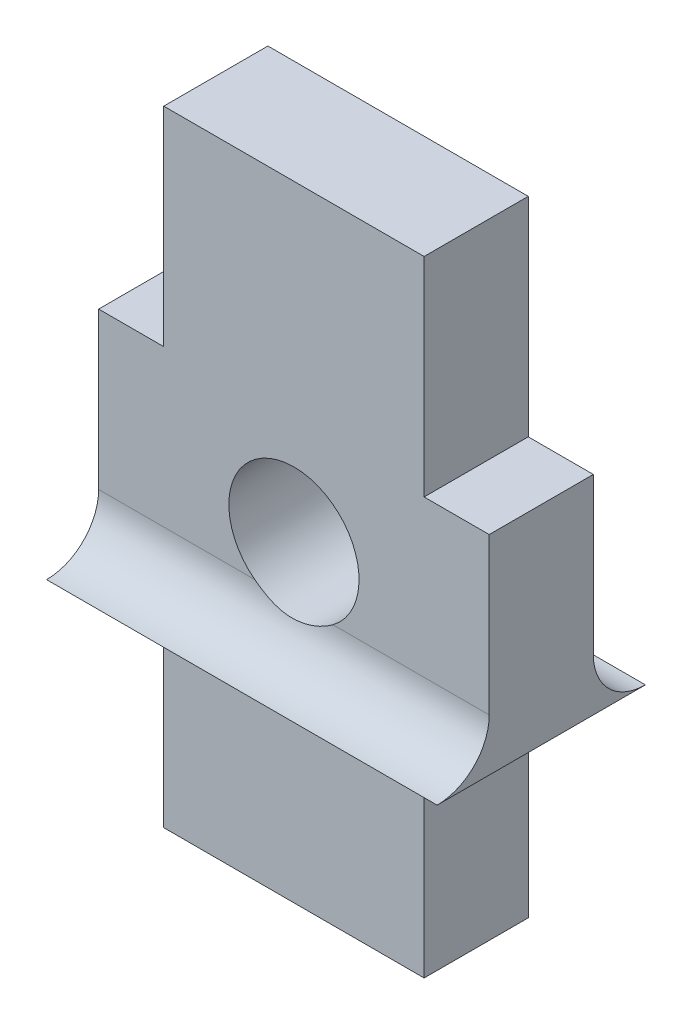
ISO-10303-21;
HEADER;
FILE_DESCRIPTION(('STEP AP214'),'2;1');
FILE_NAME('part.step','',(''),(''),'','','');
FILE_SCHEMA(('AUTOMOTIVE_DESIGN { 1 0 10303 214 1 1 1 1 }'));
ENDSEC;
DATA;
#1=APPLICATION_CONTEXT('core data for automotive mechanical design processes');
#2=APPLICATION_PROTOCOL_DEFINITION('international standard','automotive_design',2000,#1);
#3=PRODUCT_CONTEXT('',#1,'mechanical');
#4=PRODUCT('Part','Part','',(#3));
#5=PRODUCT_RELATED_PRODUCT_CATEGORY('part','',(#4));
#6=PRODUCT_DEFINITION_FORMATION('','',#4);
#7=PRODUCT_DEFINITION_CONTEXT('part definition',#1,'design');
#8=PRODUCT_DEFINITION('design','',#6,#7);
#9=PRODUCT_DEFINITION_SHAPE('','',#8);
#10=(LENGTH_UNIT() NAMED_UNIT(*) SI_UNIT(.MILLI.,.METRE.));
#11=(NAMED_UNIT(*) PLANE_ANGLE_UNIT() SI_UNIT($,.RADIAN.));
#12=(NAMED_UNIT(*) SI_UNIT($,.STERADIAN.) SOLID_ANGLE_UNIT());
#13=UNCERTAINTY_MEASURE_WITH_UNIT(LENGTH_MEASURE(1.E-05),#10,'distance_accuracy_value','');
#14=(GEOMETRIC_REPRESENTATION_CONTEXT(3) GLOBAL_UNCERTAINTY_ASSIGNED_CONTEXT((#13)) GLOBAL_UNIT_ASSIGNED_CONTEXT((#10,
#11,#12)) REPRESENTATION_CONTEXT('',''));
#15=CARTESIAN_POINT('',(0.,0.,0.));
#16=DIRECTION('',(0.,0.,1.));
#17=DIRECTION('',(1.,0.,0.));
#18=AXIS2_PLACEMENT_3D('',#15,#16,#17);
#19=CARTESIAN_POINT('',(0.,0.,0.));
#20=DIRECTION('',(0.,0.,-1.));
#21=DIRECTION('',(-1.,0.,0.));
#22=AXIS2_PLACEMENT_3D('',#19,#20,#21);
#23=PLANE('',#22);
#24=DIRECTION('',(-1.,0.,0.));
#25=VECTOR('',#24,1.);
#26=CARTESIAN_POINT('',(1959.84102228349,1459.88411595094,0.));
#27=LINE('',#26,#25);
#28=CARTESIAN_POINT('',(1953.92680872112,1459.88411595094,0.));
#29=VERTEX_POINT('',#28);
#30=CARTESIAN_POINT('',(1950.92680872112,1459.88411595094,0.));
#31=VERTEX_POINT('',#30);
#32=EDGE_CURVE('E50',#29,#31,#27,.T.);
#33=ORIENTED_EDGE('',*,*,#32,.T.);
#34=DIRECTION('',(0.,-1.,0.));
#35=VECTOR('',#34,1.);
#36=CARTESIAN_POINT('',(1950.92680872112,1462.88411595094,0.));
#37=LINE('',#36,#35);
#38=CARTESIAN_POINT('',(1950.92680872112,1462.88411595094,0.));
#39=VERTEX_POINT('',#38);
#40=EDGE_CURVE('E225',#39,#31,#37,.T.);
#41=ORIENTED_EDGE('',*,*,#40,.F.);
#42=DIRECTION('',(-1.,0.,0.));
#43=VECTOR('',#42,1.);
#44=CARTESIAN_POINT('',(1952.17680872112,1462.88411595094,0.));
#45=LINE('',#44,#43);
#46=CARTESIAN_POINT('',(1952.17680872112,1462.88411595094,0.));
#47=VERTEX_POINT('',#46);
#48=EDGE_CURVE('E223',#47,#39,#45,.T.);
#49=ORIENTED_EDGE('',*,*,#48,.F.);
#50=DIRECTION('',(0.,-1.,0.));
#51=VECTOR('',#50,1.);
#52=CARTESIAN_POINT('',(1952.17680872112,1462.88411595094,0.));
#53=LINE('',#52,#51);
#54=CARTESIAN_POINT('',(1952.17680872112,1466.88411595094,0.));
#55=VERTEX_POINT('',#54);
#56=EDGE_CURVE('E221',#55,#47,#53,.T.);
#57=ORIENTED_EDGE('',*,*,#56,.F.);
#58=DIRECTION('',(-1.,0.,0.));
#59=VECTOR('',#58,1.);
#60=CARTESIAN_POINT('',(1952.17680872112,1466.88411595094,0.));
#61=LINE('',#60,#59);
#62=CARTESIAN_POINT('',(1957.17680872112,1466.88411595094,0.));
#63=VERTEX_POINT('',#62);
#64=EDGE_CURVE('E219',#63,#55,#61,.T.);
#65=ORIENTED_EDGE('',*,*,#64,.F.);
#66=DIRECTION('',(0.,1.,0.));
#67=VECTOR('',#66,1.);
#68=CARTESIAN_POINT('',(1957.17680872112,1462.88411595094,0.));
#69=LINE('',#68,#67);
#70=CARTESIAN_POINT('',(1957.17680872112,1462.88411595094,0.));
#71=VERTEX_POINT('',#70);
#72=EDGE_CURVE('E190',#71,#63,#69,.T.);
#73=ORIENTED_EDGE('',*,*,#72,.F.);
#74=DIRECTION('',(-1.,0.,0.));
#75=VECTOR('',#74,1.);
#76=CARTESIAN_POINT('',(1957.17680872112,1462.88411595094,0.));
#77=LINE('',#76,#75);
#78=CARTESIAN_POINT('',(1958.42680872112,1462.88411595094,0.));
#79=VERTEX_POINT('',#78);
#80=EDGE_CURVE('E196',#79,#71,#77,.T.);
#81=ORIENTED_EDGE('',*,*,#80,.F.);
#82=DIRECTION('',(1.11022302462522E-13,1.,0.));
#83=VECTOR('',#82,1.);
#84=CARTESIAN_POINT('',(1958.42680872112,1462.88411595094,0.));
#85=LINE('',#84,#83);
#86=CARTESIAN_POINT('',(1958.42680872112,1459.88411595094,0.));
#87=VERTEX_POINT('',#86);
#88=EDGE_CURVE('E57',#87,#79,#85,.T.);
#89=ORIENTED_EDGE('',*,*,#88,.F.);
#90=CARTESIAN_POINT('',(1955.42680872111,1459.88411595094,0.));
#91=VERTEX_POINT('',#90);
#92=EDGE_CURVE('E153',#87,#91,#27,.T.);
#93=ORIENTED_EDGE('',*,*,#92,.T.);
#94=CARTESIAN_POINT('',(1954.67680872112,1460.88411595095,0.));
#95=DIRECTION('',(0.,0.,1.));
#96=DIRECTION('',(1.,0.,0.));
#97=AXIS2_PLACEMENT_3D('',#94,#95,#96);
#98=CIRCLE('',#97,1.24999999999997);
#99=EDGE_CURVE('E158',#91,#29,#98,.T.);
#100=ORIENTED_EDGE('',*,*,#99,.T.);
#101=EDGE_LOOP('',(#33,#41,#49,#57,#65,#73,#81,#89,#93,#100));
#102=FACE_BOUND('',#101,.T.);
#103=ADVANCED_FACE('F35',(#102),#23,.T.);
#104=CARTESIAN_POINT('',(0.,0.,2.));
#105=DIRECTION('',(0.,0.,-1.));
#106=DIRECTION('',(-1.,0.,0.));
#107=AXIS2_PLACEMENT_3D('',#104,#105,#106);
#108=PLANE('',#107);
#109=DIRECTION('',(0.,1.,0.));
#110=VECTOR('',#109,1.);
#111=CARTESIAN_POINT('',(1957.17680872112,1458.88411595094,2.));
#112=LINE('',#111,#110);
#113=CARTESIAN_POINT('',(1957.17680872112,1454.88411595094,2.));
#114=VERTEX_POINT('',#113);
#115=CARTESIAN_POINT('',(1957.17680872112,1458.88411595094,2.));
#116=VERTEX_POINT('',#115);
#117=EDGE_CURVE('E209',#114,#116,#112,.T.);
#118=ORIENTED_EDGE('',*,*,#117,.T.);
#119=DIRECTION('',(-1.,0.,0.));
#120=VECTOR('',#119,1.);
#121=CARTESIAN_POINT('',(1959.84102228349,1458.88411595094,2.));
#122=LINE('',#121,#120);
#123=CARTESIAN_POINT('',(1952.17680872112,1458.88411595094,2.));
#124=VERTEX_POINT('',#123);
#125=EDGE_CURVE('E179',#116,#124,#122,.T.);
#126=ORIENTED_EDGE('',*,*,#125,.T.);
#127=DIRECTION('',(-2.22044604925031E-13,-1.,0.));
#128=VECTOR('',#127,1.);
#129=CARTESIAN_POINT('',(1952.17680872112,1458.88411595094,2.));
#130=LINE('',#129,#128);
#131=CARTESIAN_POINT('',(1952.17680872112,1454.88411595094,2.));
#132=VERTEX_POINT('',#131);
#133=EDGE_CURVE('E205',#124,#132,#130,.T.);
#134=ORIENTED_EDGE('',*,*,#133,.T.);
#135=DIRECTION('',(1.,0.,0.));
#136=VECTOR('',#135,1.);
#137=CARTESIAN_POINT('',(1952.17680872112,1454.88411595094,2.));
#138=LINE('',#137,#136);
#139=EDGE_CURVE('E207',#132,#114,#138,.T.);
#140=ORIENTED_EDGE('',*,*,#139,.T.);
#141=EDGE_LOOP('',(#118,#126,#134,#140));
#142=FACE_BOUND('',#141,.T.);
#143=ADVANCED_FACE('F323',(#142),#108,.F.);
#144=DIRECTION('',(0.,-1.,0.));
#145=VECTOR('',#144,1.);
#146=CARTESIAN_POINT('',(1950.92680872112,1462.88411595094,2.));
#147=LINE('',#146,#145);
#148=CARTESIAN_POINT('',(1950.92680872112,1462.88411595094,2.));
#149=VERTEX_POINT('',#148);
#150=CARTESIAN_POINT('',(1950.92680872112,1459.88411595094,2.));
#151=VERTEX_POINT('',#150);
#152=EDGE_CURVE('E202',#149,#151,#147,.T.);
#153=ORIENTED_EDGE('',*,*,#152,.T.);
#154=DIRECTION('',(-1.,0.,0.));
#155=VECTOR('',#154,1.);
#156=CARTESIAN_POINT('',(1959.84102228349,1459.88411595094,2.));
#157=LINE('',#156,#155);
#158=CARTESIAN_POINT('',(1953.92680872112,1459.88411595094,2.));
#159=VERTEX_POINT('',#158);
#160=EDGE_CURVE('E184',#159,#151,#157,.T.);
#161=ORIENTED_EDGE('',*,*,#160,.F.);
#162=CARTESIAN_POINT('',(1954.67680872112,1460.88411595095,2.));
#163=DIRECTION('',(0.,0.,1.));
#164=DIRECTION('',(1.,0.,0.));
#165=AXIS2_PLACEMENT_3D('',#162,#163,#164);
#166=CIRCLE('',#165,1.24999999999997);
#167=CARTESIAN_POINT('',(1955.42680872111,1459.88411595094,2.00000000000006));
#168=VERTEX_POINT('',#167);
#169=EDGE_CURVE('E160',#168,#159,#166,.T.);
#170=ORIENTED_EDGE('',*,*,#169,.F.);
#171=CARTESIAN_POINT('',(1958.42680872112,1459.88411595094,2.));
#172=VERTEX_POINT('',#171);
#173=EDGE_CURVE('E181',#172,#168,#157,.T.);
#174=ORIENTED_EDGE('',*,*,#173,.F.);
#175=DIRECTION('',(1.11022302462522E-13,1.,0.));
#176=VECTOR('',#175,1.);
#177=CARTESIAN_POINT('',(1958.42680872112,1462.88411595094,2.));
#178=LINE('',#177,#176);
#179=CARTESIAN_POINT('',(1958.42680872112,1462.88411595094,2.));
#180=VERTEX_POINT('',#179);
#181=EDGE_CURVE('E212',#172,#180,#178,.T.);
#182=ORIENTED_EDGE('',*,*,#181,.T.);
#183=DIRECTION('',(-1.,0.,0.));
#184=VECTOR('',#183,1.);
#185=CARTESIAN_POINT('',(1957.17680872112,1462.88411595094,2.));
#186=LINE('',#185,#184);
#187=CARTESIAN_POINT('',(1957.17680872112,1462.88411595094,2.));
#188=VERTEX_POINT('',#187);
#189=EDGE_CURVE('E214',#180,#188,#186,.T.);
#190=ORIENTED_EDGE('',*,*,#189,.T.);
#191=DIRECTION('',(0.,1.,0.));
#192=VECTOR('',#191,1.);
#193=CARTESIAN_POINT('',(1957.17680872112,1462.88411595094,2.));
#194=LINE('',#193,#192);
#195=CARTESIAN_POINT('',(1957.17680872112,1466.88411595094,2.));
#196=VERTEX_POINT('',#195);
#197=EDGE_CURVE('E192',#188,#196,#194,.T.);
#198=ORIENTED_EDGE('',*,*,#197,.T.);
#199=DIRECTION('',(-1.,0.,0.));
#200=VECTOR('',#199,1.);
#201=CARTESIAN_POINT('',(1952.17680872112,1466.88411595094,2.));
#202=LINE('',#201,#200);
#203=CARTESIAN_POINT('',(1952.17680872112,1466.88411595094,2.));
#204=VERTEX_POINT('',#203);
#205=EDGE_CURVE('E195',#196,#204,#202,.T.);
#206=ORIENTED_EDGE('',*,*,#205,.T.);
#207=DIRECTION('',(0.,-1.,0.));
#208=VECTOR('',#207,1.);
#209=CARTESIAN_POINT('',(1952.17680872112,1462.88411595094,2.));
#210=LINE('',#209,#208);
#211=CARTESIAN_POINT('',(1952.17680872112,1462.88411595094,2.));
#212=VERTEX_POINT('',#211);
#213=EDGE_CURVE('E198',#204,#212,#210,.T.);
#214=ORIENTED_EDGE('',*,*,#213,.T.);
#215=DIRECTION('',(-1.,0.,0.));
#216=VECTOR('',#215,1.);
#217=CARTESIAN_POINT('',(1952.17680872112,1462.88411595094,2.));
#218=LINE('',#217,#216);
#219=EDGE_CURVE('E200',#212,#149,#218,.T.);
#220=ORIENTED_EDGE('',*,*,#219,.T.);
#221=EDGE_LOOP('',(#153,#161,#170,#174,#182,#190,#198,#206,#214,#220));
#222=FACE_BOUND('',#221,.T.);
#223=ADVANCED_FACE('F282',(#222),#108,.F.);
#224=DIRECTION('',(-1.,0.,0.));
#225=VECTOR('',#224,1.);
#226=CARTESIAN_POINT('',(1959.84102228349,1458.88411595094,0.));
#227=LINE('',#226,#225);
#228=CARTESIAN_POINT('',(1957.17680872112,1458.88411595094,0.));
#229=VERTEX_POINT('',#228);
#230=CARTESIAN_POINT('',(1952.17680872112,1458.88411595094,0.));
#231=VERTEX_POINT('',#230);
#232=EDGE_CURVE('E167',#229,#231,#227,.T.);
#233=ORIENTED_EDGE('',*,*,#232,.F.);
#234=DIRECTION('',(0.,1.,0.));
#235=VECTOR('',#234,1.);
#236=CARTESIAN_POINT('',(1957.17680872112,1458.88411595094,0.));
#237=LINE('',#236,#235);
#238=CARTESIAN_POINT('',(1957.17680872112,1454.88411595094,0.));
#239=VERTEX_POINT('',#238);
#240=EDGE_CURVE('E231',#239,#229,#237,.T.);
#241=ORIENTED_EDGE('',*,*,#240,.F.);
#242=DIRECTION('',(1.,0.,0.));
#243=VECTOR('',#242,1.);
#244=CARTESIAN_POINT('',(1952.17680872112,1454.88411595094,0.));
#245=LINE('',#244,#243);
#246=CARTESIAN_POINT('',(1952.17680872112,1454.88411595094,0.));
#247=VERTEX_POINT('',#246);
#248=EDGE_CURVE('E229',#247,#239,#245,.T.);
#249=ORIENTED_EDGE('',*,*,#248,.F.);
#250=DIRECTION('',(-2.22044604925031E-13,-1.,0.));
#251=VECTOR('',#250,1.);
#252=CARTESIAN_POINT('',(1952.17680872112,1458.88411595094,0.));
#253=LINE('',#252,#251);
#254=EDGE_CURVE('E227',#231,#247,#253,.T.);
#255=ORIENTED_EDGE('',*,*,#254,.F.);
#256=EDGE_LOOP('',(#233,#241,#249,#255));
#257=FACE_BOUND('',#256,.T.);
#258=ADVANCED_FACE('F325',(#257),#23,.T.);
#259=CARTESIAN_POINT('',(1957.17680872112,1462.88411595094,2.));
#260=DIRECTION('',(-1.,0.,0.));
#261=DIRECTION('',(0.,0.,1.));
#262=AXIS2_PLACEMENT_3D('',#259,#260,#261);
#263=PLANE('',#262);
#264=ORIENTED_EDGE('',*,*,#72,.T.);
#265=DIRECTION('',(0.,0.,-1.));
#266=VECTOR('',#265,1.);
#267=CARTESIAN_POINT('',(1957.17680872112,1466.88411595094,2.));
#268=LINE('',#267,#266);
#269=EDGE_CURVE('E11',#196,#63,#268,.T.);
#270=ORIENTED_EDGE('',*,*,#269,.F.);
#271=ORIENTED_EDGE('',*,*,#197,.F.);
#272=DIRECTION('',(0.,0.,-1.));
#273=VECTOR('',#272,1.);
#274=CARTESIAN_POINT('',(1957.17680872112,1462.88411595094,2.));
#275=LINE('',#274,#273);
#276=EDGE_CURVE('E216',#188,#71,#275,.T.);
#277=ORIENTED_EDGE('',*,*,#276,.T.);
#278=EDGE_LOOP('',(#264,#270,#271,#277));
#279=FACE_BOUND('',#278,.T.);
#280=ADVANCED_FACE('F37',(#279),#263,.F.);
#281=CARTESIAN_POINT('',(1952.17680872112,1466.88411595094,2.));
#282=DIRECTION('',(0.,-1.,0.));
#283=DIRECTION('',(0.,0.,-1.));
#284=AXIS2_PLACEMENT_3D('',#281,#282,#283);
#285=PLANE('',#284);
#286=ORIENTED_EDGE('',*,*,#64,.T.);
#287=DIRECTION('',(0.,0.,-1.));
#288=VECTOR('',#287,1.);
#289=CARTESIAN_POINT('',(1952.17680872112,1466.88411595094,2.));
#290=LINE('',#289,#288);
#291=EDGE_CURVE('E43',#204,#55,#290,.T.);
#292=ORIENTED_EDGE('',*,*,#291,.F.);
#293=ORIENTED_EDGE('',*,*,#205,.F.);
#294=ORIENTED_EDGE('',*,*,#269,.T.);
#295=EDGE_LOOP('',(#286,#292,#293,#294));
#296=FACE_BOUND('',#295,.T.);
#297=ADVANCED_FACE('F286',(#296),#285,.F.);
#298=CARTESIAN_POINT('',(1952.17680872112,1462.88411595094,2.));
#299=DIRECTION('',(1.,0.,0.));
#300=DIRECTION('',(0.,0.,-1.));
#301=AXIS2_PLACEMENT_3D('',#298,#299,#300);
#302=PLANE('',#301);
#303=ORIENTED_EDGE('',*,*,#56,.T.);
#304=DIRECTION('',(0.,0.,-1.));
#305=VECTOR('',#304,1.);
#306=CARTESIAN_POINT('',(1952.17680872112,1462.88411595094,2.));
#307=LINE('',#306,#305);
#308=EDGE_CURVE('E259',#212,#47,#307,.T.);
#309=ORIENTED_EDGE('',*,*,#308,.F.);
#310=ORIENTED_EDGE('',*,*,#213,.F.);
#311=ORIENTED_EDGE('',*,*,#291,.T.);
#312=EDGE_LOOP('',(#303,#309,#310,#311));
#313=FACE_BOUND('',#312,.T.);
#314=ADVANCED_FACE('F266',(#313),#302,.F.);
#315=CARTESIAN_POINT('',(1952.17680872112,1462.88411595094,2.));
#316=DIRECTION('',(0.,-1.,0.));
#317=DIRECTION('',(0.,0.,-1.));
#318=AXIS2_PLACEMENT_3D('',#315,#316,#317);
#319=PLANE('',#318);
#320=ORIENTED_EDGE('',*,*,#48,.T.);
#321=DIRECTION('',(0.,0.,-1.));
#322=VECTOR('',#321,1.);
#323=CARTESIAN_POINT('',(1950.92680872112,1462.88411595094,2.));
#324=LINE('',#323,#322);
#325=EDGE_CURVE('E256',#149,#39,#324,.T.);
#326=ORIENTED_EDGE('',*,*,#325,.F.);
#327=ORIENTED_EDGE('',*,*,#219,.F.);
#328=ORIENTED_EDGE('',*,*,#308,.T.);
#329=EDGE_LOOP('',(#320,#326,#327,#328));
#330=FACE_BOUND('',#329,.T.);
#331=ADVANCED_FACE('F273',(#330),#319,.F.);
#332=CARTESIAN_POINT('',(1950.92680872112,1462.88411595094,2.));
#333=DIRECTION('',(1.,0.,0.));
#334=DIRECTION('',(0.,0.,-1.));
#335=AXIS2_PLACEMENT_3D('',#332,#333,#334);
#336=PLANE('',#335);
#337=ORIENTED_EDGE('',*,*,#40,.T.);
#338=CARTESIAN_POINT('',(1950.92680872112,1459.88411595094,-1.));
#339=DIRECTION('',(1.,0.,0.));
#340=DIRECTION('',(0.,0.,-1.));
#341=AXIS2_PLACEMENT_3D('',#338,#339,#340);
#342=CIRCLE('',#341,0.999999999999945);
#343=CARTESIAN_POINT('',(1950.92680872112,1458.88411595094,-1.));
#344=VERTEX_POINT('',#343);
#345=EDGE_CURVE('E170',#31,#344,#342,.T.);
#346=ORIENTED_EDGE('',*,*,#345,.T.);
#347=DIRECTION('',(0.,0.,-1.));
#348=VECTOR('',#347,1.);
#349=CARTESIAN_POINT('',(1950.92680872112,1458.88411595094,2.));
#350=LINE('',#349,#348);
#351=CARTESIAN_POINT('',(1950.92680872112,1458.88411595094,3.));
#352=VERTEX_POINT('',#351);
#353=EDGE_CURVE('E254',#352,#344,#350,.T.);
#354=ORIENTED_EDGE('',*,*,#353,.F.);
#355=CARTESIAN_POINT('',(1950.92680872112,1459.88411595094,3.));
#356=DIRECTION('',(1.,0.,0.));
#357=DIRECTION('',(0.,0.,1.));
#358=AXIS2_PLACEMENT_3D('',#355,#356,#357);
#359=CIRCLE('',#358,0.999999999999945);
#360=EDGE_CURVE('E165',#352,#151,#359,.T.);
#361=ORIENTED_EDGE('',*,*,#360,.T.);
#362=ORIENTED_EDGE('',*,*,#152,.F.);
#363=ORIENTED_EDGE('',*,*,#325,.T.);
#364=EDGE_LOOP('',(#337,#346,#354,#361,#362,#363));
#365=FACE_BOUND('',#364,.T.);
#366=ADVANCED_FACE('F277',(#365),#336,.F.);
#367=CARTESIAN_POINT('',(1952.17680872112,1458.88411595094,2.));
#368=DIRECTION('',(1.,-2.22044604925031E-13,0.));
#369=DIRECTION('',(2.22044604925031E-13,1.,0.));
#370=AXIS2_PLACEMENT_3D('',#367,#368,#369);
#371=PLANE('',#370);
#372=ORIENTED_EDGE('',*,*,#254,.T.);
#373=DIRECTION('',(0.,0.,-1.));
#374=VECTOR('',#373,1.);
#375=CARTESIAN_POINT('',(1952.17680872112,1454.88411595094,2.));
#376=LINE('',#375,#374);
#377=EDGE_CURVE('E249',#132,#247,#376,.T.);
#378=ORIENTED_EDGE('',*,*,#377,.F.);
#379=ORIENTED_EDGE('',*,*,#133,.F.);
#380=DIRECTION('',(0.,0.,-1.));
#381=VECTOR('',#380,1.);
#382=CARTESIAN_POINT('',(1952.17680872112,1458.88411595094,2.));
#383=LINE('',#382,#381);
#384=EDGE_CURVE('E252',#124,#231,#383,.T.);
#385=ORIENTED_EDGE('',*,*,#384,.T.);
#386=EDGE_LOOP('',(#372,#378,#379,#385));
#387=FACE_BOUND('',#386,.T.);
#388=ADVANCED_FACE('F354',(#387),#371,.F.);
#389=CARTESIAN_POINT('',(1952.17680872112,1454.88411595094,2.));
#390=DIRECTION('',(0.,1.,0.));
#391=DIRECTION('',(0.,0.,1.));
#392=AXIS2_PLACEMENT_3D('',#389,#390,#391);
#393=PLANE('',#392);
#394=ORIENTED_EDGE('',*,*,#248,.T.);
#395=DIRECTION('',(0.,0.,-1.));
#396=VECTOR('',#395,1.);
#397=CARTESIAN_POINT('',(1957.17680872112,1454.88411595094,2.));
#398=LINE('',#397,#396);
#399=EDGE_CURVE('E246',#114,#239,#398,.T.);
#400=ORIENTED_EDGE('',*,*,#399,.F.);
#401=ORIENTED_EDGE('',*,*,#139,.F.);
#402=ORIENTED_EDGE('',*,*,#377,.T.);
#403=EDGE_LOOP('',(#394,#400,#401,#402));
#404=FACE_BOUND('',#403,.T.);
#405=ADVANCED_FACE('F352',(#404),#393,.F.);
#406=CARTESIAN_POINT('',(1957.17680872112,1458.88411595094,2.));
#407=DIRECTION('',(-1.,0.,0.));
#408=DIRECTION('',(0.,0.,1.));
#409=AXIS2_PLACEMENT_3D('',#406,#407,#408);
#410=PLANE('',#409);
#411=ORIENTED_EDGE('',*,*,#240,.T.);
#412=DIRECTION('',(0.,0.,-1.));
#413=VECTOR('',#412,1.);
#414=CARTESIAN_POINT('',(1957.17680872112,1458.88411595094,2.));
#415=LINE('',#414,#413);
#416=EDGE_CURVE('E243',#116,#229,#415,.T.);
#417=ORIENTED_EDGE('',*,*,#416,.F.);
#418=ORIENTED_EDGE('',*,*,#117,.F.);
#419=ORIENTED_EDGE('',*,*,#399,.T.);
#420=EDGE_LOOP('',(#411,#417,#418,#419));
#421=FACE_BOUND('',#420,.T.);
#422=ADVANCED_FACE('F345',(#421),#410,.F.);
#423=CARTESIAN_POINT('',(1957.17680872112,1458.88411595094,2.));
#424=DIRECTION('',(0.,1.,0.));
#425=DIRECTION('',(0.,0.,1.));
#426=AXIS2_PLACEMENT_3D('',#423,#424,#425);
#427=PLANE('',#426);
#428=ORIENTED_EDGE('',*,*,#232,.T.);
#429=ORIENTED_EDGE('',*,*,#384,.F.);
#430=ORIENTED_EDGE('',*,*,#125,.F.);
#431=ORIENTED_EDGE('',*,*,#416,.T.);
#432=EDGE_LOOP('',(#428,#429,#430,#431));
#433=FACE_BOUND('',#432,.T.);
#434=ORIENTED_EDGE('',*,*,#353,.T.);
#435=DIRECTION('',(-1.,0.,0.));
#436=VECTOR('',#435,1.);
#437=CARTESIAN_POINT('',(1959.84102228349,1458.88411595094,-1.));
#438=LINE('',#437,#436);
#439=CARTESIAN_POINT('',(1958.42680872112,1458.88411595094,-1.));
#440=VERTEX_POINT('',#439);
#441=EDGE_CURVE('E173',#440,#344,#438,.T.);
#442=ORIENTED_EDGE('',*,*,#441,.F.);
#443=DIRECTION('',(0.,0.,-1.));
#444=VECTOR('',#443,1.);
#445=CARTESIAN_POINT('',(1958.42680872112,1458.88411595094,2.));
#446=LINE('',#445,#444);
#447=CARTESIAN_POINT('',(1958.42680872112,1458.88411595094,3.));
#448=VERTEX_POINT('',#447);
#449=EDGE_CURVE('E241',#448,#440,#446,.T.);
#450=ORIENTED_EDGE('',*,*,#449,.F.);
#451=DIRECTION('',(-1.,0.,0.));
#452=VECTOR('',#451,1.);
#453=CARTESIAN_POINT('',(1959.84102228349,1458.88411595094,3.));
#454=LINE('',#453,#452);
#455=EDGE_CURVE('E178',#448,#352,#454,.T.);
#456=ORIENTED_EDGE('',*,*,#455,.T.);
#457=EDGE_LOOP('',(#434,#442,#450,#456));
#458=FACE_BOUND('',#457,.T.);
#459=ADVANCED_FACE('F298',(#433,#458),#427,.F.);
#460=CARTESIAN_POINT('',(1958.42680872112,1462.88411595094,2.));
#461=DIRECTION('',(-1.,1.11022302462522E-13,0.));
#462=DIRECTION('',(-1.11022302462522E-13,-1.,0.));
#463=AXIS2_PLACEMENT_3D('',#460,#461,#462);
#464=PLANE('',#463);
#465=ORIENTED_EDGE('',*,*,#449,.T.);
#466=CARTESIAN_POINT('',(1958.42680872112,1459.88411595094,-1.));
#467=DIRECTION('',(-1.,1.11022302462522E-13,0.));
#468=DIRECTION('',(-1.11022302462522E-13,-1.,0.));
#469=AXIS2_PLACEMENT_3D('',#466,#467,#468);
#470=CIRCLE('',#469,0.999999999999945);
#471=EDGE_CURVE('E163',#440,#87,#470,.T.);
#472=ORIENTED_EDGE('',*,*,#471,.T.);
#473=ORIENTED_EDGE('',*,*,#88,.T.);
#474=DIRECTION('',(0.,0.,-1.));
#475=VECTOR('',#474,1.);
#476=CARTESIAN_POINT('',(1958.42680872112,1462.88411595094,2.));
#477=LINE('',#476,#475);
#478=EDGE_CURVE('E238',#180,#79,#477,.T.);
#479=ORIENTED_EDGE('',*,*,#478,.F.);
#480=ORIENTED_EDGE('',*,*,#181,.F.);
#481=CARTESIAN_POINT('',(1958.42680872112,1459.88411595094,3.));
#482=DIRECTION('',(-1.,1.11022302462522E-13,0.));
#483=DIRECTION('',(-1.11022302462522E-13,-1.,0.));
#484=AXIS2_PLACEMENT_3D('',#481,#482,#483);
#485=CIRCLE('',#484,0.999999999999945);
#486=EDGE_CURVE('E161',#172,#448,#485,.T.);
#487=ORIENTED_EDGE('',*,*,#486,.T.);
#488=EDGE_LOOP('',(#465,#472,#473,#479,#480,#487));
#489=FACE_BOUND('',#488,.T.);
#490=ADVANCED_FACE('F295',(#489),#464,.F.);
#491=CARTESIAN_POINT('',(1957.17680872112,1462.88411595094,2.));
#492=DIRECTION('',(0.,-1.,0.));
#493=DIRECTION('',(0.,0.,-1.));
#494=AXIS2_PLACEMENT_3D('',#491,#492,#493);
#495=PLANE('',#494);
#496=ORIENTED_EDGE('',*,*,#80,.T.);
#497=ORIENTED_EDGE('',*,*,#276,.F.);
#498=ORIENTED_EDGE('',*,*,#189,.F.);
#499=ORIENTED_EDGE('',*,*,#478,.T.);
#500=EDGE_LOOP('',(#496,#497,#498,#499));
#501=FACE_BOUND('',#500,.T.);
#502=ADVANCED_FACE('F290',(#501),#495,.F.);
#503=CARTESIAN_POINT('',(1954.67680872112,1460.88411595095,2.));
#504=DIRECTION('',(0.,0.,-1.));
#505=DIRECTION('',(-1.,0.,0.));
#506=AXIS2_PLACEMENT_3D('',#503,#504,#505);
#507=CYLINDRICAL_SURFACE('',#506,1.24999999999997);
#508=ORIENTED_EDGE('',*,*,#169,.T.);
#509=CARTESIAN_POINT('',(1953.92680872112,1459.88411595094,2.00000000000006));
#510=CARTESIAN_POINT('',(1953.95464186426,1459.86324053161,2.00000413601019));
#511=CARTESIAN_POINT('',(1953.98332445631,1459.84354558404,2.00065286249592));
#512=CARTESIAN_POINT('',(1954.04219362052,1459.80663247636,2.00283435504111));
#513=CARTESIAN_POINT('',(1954.07237951385,1459.78941321175,2.00436672532793));
#514=CARTESIAN_POINT('',(1954.16493643226,1459.74161719196,2.00968314842704));
#515=CARTESIAN_POINT('',(1954.22930871718,1459.71490069901,2.01418657178201));
#516=CARTESIAN_POINT('',(1954.36159209563,1459.67251971499,2.02240246556453));
#517=CARTESIAN_POINT('',(1954.42950212547,1459.65685192226,2.02611517204895));
#518=CARTESIAN_POINT('',(1954.56700929288,1459.63701636227,2.03095427102973));
#519=CARTESIAN_POINT('',(1954.63660414283,1459.63283379689,2.03208399125503));
#520=CARTESIAN_POINT('',(1954.77504472976,1459.63607168941,2.03125053742804));
#521=CARTESIAN_POINT('',(1954.84389239719,1459.64341702368,2.02930738765252));
#522=CARTESIAN_POINT('',(1954.97939950408,1459.66933001508,2.02324979340273));
#523=CARTESIAN_POINT('',(1955.04605666205,1459.68790900477,2.01913315683881));
#524=CARTESIAN_POINT('',(1955.16719027573,1459.7327467703,2.01129786180112));
#525=CARTESIAN_POINT('',(1955.2221396564,1459.75773340367,2.00759490859268));
#526=CARTESIAN_POINT('',(1955.30142399057,1459.80094387527,2.00336036664711));
#527=CARTESIAN_POINT('',(1955.32731779593,1459.816294206,2.00216907514131));
#528=CARTESIAN_POINT('',(1955.3779580889,1459.84884011021,2.00048997066709));
#529=CARTESIAN_POINT('',(1955.40270404076,1459.86603653315,2.00000248305203));
#530=CARTESIAN_POINT('',(1955.42680872111,1459.88411595094,2.00000000000006));
#531=B_SPLINE_CURVE_WITH_KNOTS('',3,(#509,#510,#511,#512,#513,#514,#515,#516,#517,#518,#519,
#520,#521,#522,#523,#524,#525,#526,#527,#528,#529,#530),.UNSPECIFIED.,.F.,.F.,(4,2,2,2,2,2,2,2,
2,2,4),(0.,0.104289480114433,0.208532286557596,0.417010423227884,0.625426234310823,
0.833573386174511,1.04036973220732,1.24737504408885,1.42813829488587,1.51843817128817,
1.60877977802348),.UNSPECIFIED.);
#532=EDGE_CURVE('E156',#159,#168,#531,.T.);
#533=ORIENTED_EDGE('',*,*,#532,.T.);
#534=EDGE_LOOP('',(#508,#533));
#535=FACE_BOUND('',#534,.T.);
#536=ORIENTED_EDGE('',*,*,#99,.F.);
#537=CARTESIAN_POINT('',(1955.42680872111,1459.88411595094,0.));
#538=CARTESIAN_POINT('',(1955.39897557797,1459.86324053161,-4.13601018518848E-06));
#539=CARTESIAN_POINT('',(1955.37029298592,1459.84354558404,-0.00065286249591931));
#540=CARTESIAN_POINT('',(1955.31142382171,1459.80663247636,-0.00283435504112357));
#541=CARTESIAN_POINT('',(1955.28123792838,1459.78941321175,-0.00436672532794736));
#542=CARTESIAN_POINT('',(1955.18868100997,1459.74161719196,-0.00968314842705621));
#543=CARTESIAN_POINT('',(1955.12430872505,1459.71490069901,-0.0141865717820136));
#544=CARTESIAN_POINT('',(1954.9920253466,1459.67251971499,-0.0224024655645303));
#545=CARTESIAN_POINT('',(1954.92411531676,1459.65685192226,-0.0261151720489534));
#546=CARTESIAN_POINT('',(1954.78660814936,1459.63701636227,-0.0309542710297293));
#547=CARTESIAN_POINT('',(1954.71701329941,1459.63283379689,-0.0320839912550294));
#548=CARTESIAN_POINT('',(1954.57857271248,1459.63607168941,-0.0312505374280387));
#549=CARTESIAN_POINT('',(1954.50972504504,1459.64341702368,-0.0293073876525235));
#550=CARTESIAN_POINT('',(1954.37421793816,1459.66933001508,-0.0232497934027292));
#551=CARTESIAN_POINT('',(1954.30756078018,1459.68790900477,-0.0191331568388102));
#552=CARTESIAN_POINT('',(1954.18642716651,1459.7327467703,-0.0112978618011222));
#553=CARTESIAN_POINT('',(1954.13147778584,1459.75773340367,-0.00759490859268298));
#554=CARTESIAN_POINT('',(1954.05219345166,1459.80094387527,-0.00336036664711868));
#555=CARTESIAN_POINT('',(1954.0262996463,1459.816294206,-0.00216907514131567));
#556=CARTESIAN_POINT('',(1953.97565935334,1459.84884011021,-0.000489970667087416));
#557=CARTESIAN_POINT('',(1953.95091340147,1459.86603653315,-2.48305202246684E-06));
#558=CARTESIAN_POINT('',(1953.92680872112,1459.88411595094,0.));
#559=B_SPLINE_CURVE_WITH_KNOTS('',3,(#537,#538,#539,#540,#541,#542,#543,#544,#545,#546,#547,
#548,#549,#550,#551,#552,#553,#554,#555,#556,#557,#558),.UNSPECIFIED.,.F.,.F.,(4,2,2,2,2,2,2,2,
2,2,4),(0.,0.104289480114742,0.208532286557905,0.417010423227902,0.625426234311108,
0.833573386174561,1.04036973220737,1.2473750440889,1.42813829488592,1.51843817128772,
1.60877977802353),.UNSPECIFIED.);
#560=EDGE_CURVE('E149',#91,#29,#559,.T.);
#561=ORIENTED_EDGE('',*,*,#560,.T.);
#562=EDGE_LOOP('',(#536,#561));
#563=FACE_BOUND('',#562,.T.);
#564=ADVANCED_FACE('F159',(#535,#563),#507,.F.);
#565=CARTESIAN_POINT('',(1959.84102228349,1459.88411595094,3.));
#566=DIRECTION('',(-1.,0.,0.));
#567=DIRECTION('',(0.,0.,1.));
#568=AXIS2_PLACEMENT_3D('',#565,#566,#567);
#569=CYLINDRICAL_SURFACE('',#568,0.999999999999945);
#570=ORIENTED_EDGE('',*,*,#532,.F.);
#571=ORIENTED_EDGE('',*,*,#160,.T.);
#572=ORIENTED_EDGE('',*,*,#360,.F.);
#573=ORIENTED_EDGE('',*,*,#455,.F.);
#574=ORIENTED_EDGE('',*,*,#486,.F.);
#575=ORIENTED_EDGE('',*,*,#173,.T.);
#576=EDGE_LOOP('',(#570,#571,#572,#573,#574,#575));
#577=FACE_BOUND('',#576,.T.);
#578=ADVANCED_FACE('F311',(#577),#569,.F.);
#579=CARTESIAN_POINT('',(1959.84102228349,1459.88411595094,-1.));
#580=DIRECTION('',(-1.,0.,0.));
#581=DIRECTION('',(0.,0.,1.));
#582=AXIS2_PLACEMENT_3D('',#579,#580,#581);
#583=CYLINDRICAL_SURFACE('',#582,0.999999999999945);
#584=ORIENTED_EDGE('',*,*,#560,.F.);
#585=ORIENTED_EDGE('',*,*,#92,.F.);
#586=ORIENTED_EDGE('',*,*,#471,.F.);
#587=ORIENTED_EDGE('',*,*,#441,.T.);
#588=ORIENTED_EDGE('',*,*,#345,.F.);
#589=ORIENTED_EDGE('',*,*,#32,.F.);
#590=EDGE_LOOP('',(#584,#585,#586,#587,#588,#589));
#591=FACE_BOUND('',#590,.T.);
#592=ADVANCED_FACE('F151',(#591),#583,.F.);
#593=CLOSED_SHELL('',(#103,#143,#223,#258,#280,#297,#314,#331,#366,#388,#405,#422,#459,#490,
#502,#564,#578,#592));
#594=MANIFOLD_SOLID_BREP('B2',#593);
#595=ADVANCED_BREP_SHAPE_REPRESENTATION('',(#18,#594),#14);
#596=SHAPE_DEFINITION_REPRESENTATION(#9,#595);
ENDSEC;
END-ISO-10303-21;
